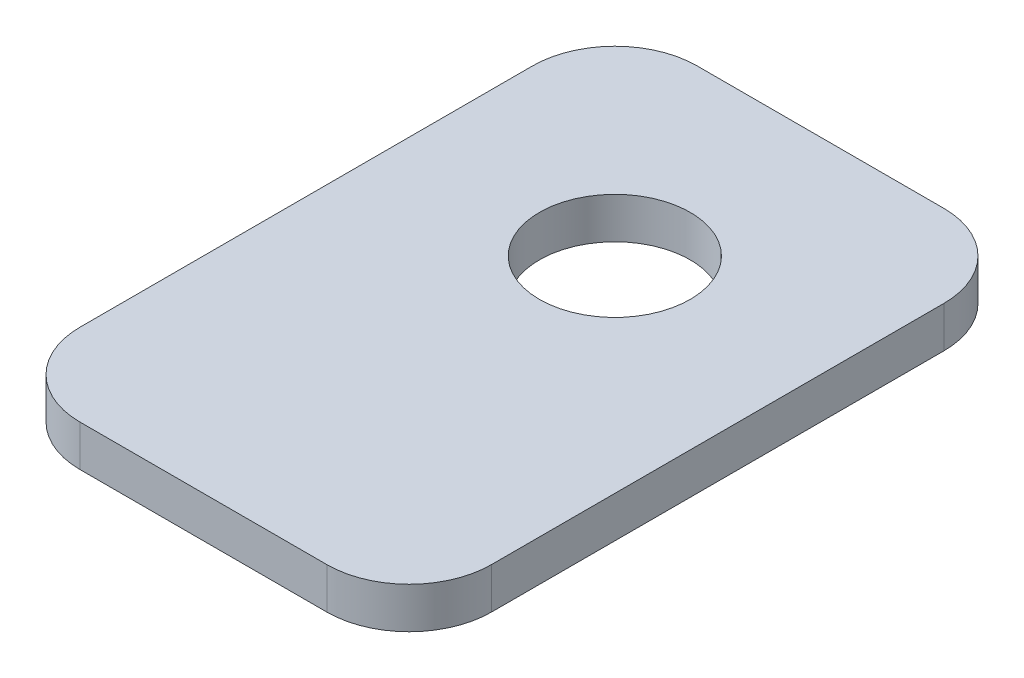
ISO-10303-21;
HEADER;
FILE_DESCRIPTION(('STEP AP214'),'2;1');
FILE_NAME('part.step','',(''),(''),'','','');
FILE_SCHEMA(('AUTOMOTIVE_DESIGN { 1 0 10303 214 1 1 1 1 }'));
ENDSEC;
DATA;
#1=APPLICATION_CONTEXT('core data for automotive mechanical design processes');
#2=APPLICATION_PROTOCOL_DEFINITION('international standard','automotive_design',2000,#1);
#3=PRODUCT_CONTEXT('',#1,'mechanical');
#4=PRODUCT('Part','Part','',(#3));
#5=PRODUCT_RELATED_PRODUCT_CATEGORY('part','',(#4));
#6=PRODUCT_DEFINITION_FORMATION('','',#4);
#7=PRODUCT_DEFINITION_CONTEXT('part definition',#1,'design');
#8=PRODUCT_DEFINITION('design','',#6,#7);
#9=PRODUCT_DEFINITION_SHAPE('','',#8);
#10=(LENGTH_UNIT() NAMED_UNIT(*) SI_UNIT(.MILLI.,.METRE.));
#11=(NAMED_UNIT(*) PLANE_ANGLE_UNIT() SI_UNIT($,.RADIAN.));
#12=(NAMED_UNIT(*) SI_UNIT($,.STERADIAN.) SOLID_ANGLE_UNIT());
#13=UNCERTAINTY_MEASURE_WITH_UNIT(LENGTH_MEASURE(1.E-05),#10,'distance_accuracy_value','');
#14=(GEOMETRIC_REPRESENTATION_CONTEXT(3) GLOBAL_UNCERTAINTY_ASSIGNED_CONTEXT((#13)) GLOBAL_UNIT_ASSIGNED_CONTEXT((#10,
#11,#12)) REPRESENTATION_CONTEXT('',''));
#15=CARTESIAN_POINT('',(0.,0.,0.));
#16=DIRECTION('',(0.,0.,1.));
#17=DIRECTION('',(1.,0.,0.));
#18=AXIS2_PLACEMENT_3D('',#15,#16,#17);
#19=CARTESIAN_POINT('',(0.,1.5,0.));
#20=DIRECTION('',(0.,1.,0.));
#21=DIRECTION('',(0.,0.,1.));
#22=AXIS2_PLACEMENT_3D('',#19,#20,#21);
#23=PLANE('',#22);
#24=CARTESIAN_POINT('',(0.,1.5,0.));
#25=DIRECTION('',(0.,1.,0.));
#26=DIRECTION('',(0.,0.,1.));
#27=AXIS2_PLACEMENT_3D('',#24,#25,#26);
#28=CIRCLE('',#27,2.75);
#29=CARTESIAN_POINT('',(0.,1.5,2.75));
#30=VERTEX_POINT('',#29);
#31=EDGE_CURVE('E156',#30,#30,#28,.F.);
#32=ORIENTED_EDGE('',*,*,#31,.T.);
#33=EDGE_LOOP('',(#32));
#34=FACE_BOUND('',#33,.T.);
#35=DIRECTION('',(1.,0.,0.));
#36=VECTOR('',#35,1.);
#37=CARTESIAN_POINT('',(-7.5,1.5,15.));
#38=LINE('',#37,#36);
#39=CARTESIAN_POINT('',(4.5,1.5,15.));
#40=VERTEX_POINT('',#39);
#41=CARTESIAN_POINT('',(-4.5,1.5,15.));
#42=VERTEX_POINT('',#41);
#43=EDGE_CURVE('E110',#40,#42,#38,.F.);
#44=ORIENTED_EDGE('',*,*,#43,.F.);
#45=CARTESIAN_POINT('',(4.5,1.5,12.));
#46=DIRECTION('',(0.,-1.,0.));
#47=DIRECTION('',(0.,0.,-1.));
#48=AXIS2_PLACEMENT_3D('',#45,#46,#47);
#49=CIRCLE('',#48,3.);
#50=CARTESIAN_POINT('',(7.5,1.5,12.));
#51=VERTEX_POINT('',#50);
#52=EDGE_CURVE('E19',#51,#40,#49,.T.);
#53=ORIENTED_EDGE('',*,*,#52,.F.);
#54=DIRECTION('',(0.,0.,-1.));
#55=VECTOR('',#54,1.);
#56=CARTESIAN_POINT('',(7.5,1.5,15.));
#57=LINE('',#56,#55);
#58=CARTESIAN_POINT('',(7.5,1.5,-4.5));
#59=VERTEX_POINT('',#58);
#60=EDGE_CURVE('E95',#59,#51,#57,.F.);
#61=ORIENTED_EDGE('',*,*,#60,.F.);
#62=CARTESIAN_POINT('',(4.5,1.5,-4.5));
#63=DIRECTION('',(0.,-1.,0.));
#64=DIRECTION('',(0.,0.,-1.));
#65=AXIS2_PLACEMENT_3D('',#62,#63,#64);
#66=CIRCLE('',#65,3.);
#67=CARTESIAN_POINT('',(4.5,1.5,-7.5));
#68=VERTEX_POINT('',#67);
#69=EDGE_CURVE('E119',#68,#59,#66,.T.);
#70=ORIENTED_EDGE('',*,*,#69,.F.);
#71=DIRECTION('',(-1.,0.,0.));
#72=VECTOR('',#71,1.);
#73=CARTESIAN_POINT('',(7.5,1.5,-7.5));
#74=LINE('',#73,#72);
#75=CARTESIAN_POINT('',(-4.5,1.5,-7.5));
#76=VERTEX_POINT('',#75);
#77=EDGE_CURVE('E135',#76,#68,#74,.F.);
#78=ORIENTED_EDGE('',*,*,#77,.F.);
#79=CARTESIAN_POINT('',(-4.5,1.5,-4.5));
#80=DIRECTION('',(0.,-1.,0.));
#81=DIRECTION('',(0.,0.,-1.));
#82=AXIS2_PLACEMENT_3D('',#79,#80,#81);
#83=CIRCLE('',#82,3.);
#84=CARTESIAN_POINT('',(-7.5,1.5,-4.5));
#85=VERTEX_POINT('',#84);
#86=EDGE_CURVE('E164',#85,#76,#83,.T.);
#87=ORIENTED_EDGE('',*,*,#86,.F.);
#88=DIRECTION('',(0.,0.,1.));
#89=VECTOR('',#88,1.);
#90=CARTESIAN_POINT('',(-7.5,1.5,-7.5));
#91=LINE('',#90,#89);
#92=CARTESIAN_POINT('',(-7.5,1.5,12.));
#93=VERTEX_POINT('',#92);
#94=EDGE_CURVE('E130',#93,#85,#91,.F.);
#95=ORIENTED_EDGE('',*,*,#94,.F.);
#96=CARTESIAN_POINT('',(-4.5,1.5,12.));
#97=DIRECTION('',(0.,-1.,0.));
#98=DIRECTION('',(0.,0.,-1.));
#99=AXIS2_PLACEMENT_3D('',#96,#97,#98);
#100=CIRCLE('',#99,3.);
#101=EDGE_CURVE('E161',#42,#93,#100,.T.);
#102=ORIENTED_EDGE('',*,*,#101,.F.);
#103=EDGE_LOOP('',(#44,#53,#61,#70,#78,#87,#95,#102));
#104=FACE_BOUND('',#103,.T.);
#105=ADVANCED_FACE('F16',(#34,#104),#23,.T.);
#106=CARTESIAN_POINT('',(4.5,5.259,12.));
#107=DIRECTION('',(0.,-1.,0.));
#108=DIRECTION('',(0.,0.,-1.));
#109=AXIS2_PLACEMENT_3D('',#106,#107,#108);
#110=CYLINDRICAL_SURFACE('',#109,3.);
#111=DIRECTION('',(0.,1.,0.));
#112=VECTOR('',#111,1.);
#113=CARTESIAN_POINT('',(4.5,0.,15.));
#114=LINE('',#113,#112);
#115=CARTESIAN_POINT('',(4.5,0.,15.));
#116=VERTEX_POINT('',#115);
#117=EDGE_CURVE('E160',#116,#40,#114,.T.);
#118=ORIENTED_EDGE('',*,*,#117,.F.);
#119=CARTESIAN_POINT('',(4.5,0.,12.));
#120=DIRECTION('',(0.,-1.,0.));
#121=DIRECTION('',(0.,0.,-1.));
#122=AXIS2_PLACEMENT_3D('',#119,#120,#121);
#123=CIRCLE('',#122,3.);
#124=CARTESIAN_POINT('',(7.5,0.,12.));
#125=VERTEX_POINT('',#124);
#126=EDGE_CURVE('E117',#116,#125,#123,.F.);
#127=ORIENTED_EDGE('',*,*,#126,.T.);
#128=DIRECTION('',(0.,1.,0.));
#129=VECTOR('',#128,1.);
#130=CARTESIAN_POINT('',(7.5,0.,12.));
#131=LINE('',#130,#129);
#132=EDGE_CURVE('E100',#51,#125,#131,.F.);
#133=ORIENTED_EDGE('',*,*,#132,.F.);
#134=ORIENTED_EDGE('',*,*,#52,.T.);
#135=EDGE_LOOP('',(#118,#127,#133,#134));
#136=FACE_BOUND('',#135,.T.);
#137=ADVANCED_FACE('F116',(#136),#110,.T.);
#138=CARTESIAN_POINT('',(7.5,0.,15.));
#139=DIRECTION('',(1.,0.,0.));
#140=DIRECTION('',(0.,0.,-1.));
#141=AXIS2_PLACEMENT_3D('',#138,#139,#140);
#142=PLANE('',#141);
#143=ORIENTED_EDGE('',*,*,#60,.T.);
#144=ORIENTED_EDGE('',*,*,#132,.T.);
#145=DIRECTION('',(0.,0.,1.));
#146=VECTOR('',#145,1.);
#147=CARTESIAN_POINT('',(7.5,0.,0.));
#148=LINE('',#147,#146);
#149=CARTESIAN_POINT('',(7.5,0.,-4.5));
#150=VERTEX_POINT('',#149);
#151=EDGE_CURVE('E153',#125,#150,#148,.F.);
#152=ORIENTED_EDGE('',*,*,#151,.T.);
#153=DIRECTION('',(0.,-1.,0.));
#154=VECTOR('',#153,1.);
#155=CARTESIAN_POINT('',(7.5,5.259,-4.5));
#156=LINE('',#155,#154);
#157=EDGE_CURVE('E102',#59,#150,#156,.T.);
#158=ORIENTED_EDGE('',*,*,#157,.F.);
#159=EDGE_LOOP('',(#143,#144,#152,#158));
#160=FACE_BOUND('',#159,.T.);
#161=ADVANCED_FACE('F97',(#160),#142,.T.);
#162=CARTESIAN_POINT('',(4.5,5.259,-4.5));
#163=DIRECTION('',(0.,-1.,0.));
#164=DIRECTION('',(0.,0.,-1.));
#165=AXIS2_PLACEMENT_3D('',#162,#163,#164);
#166=CYLINDRICAL_SURFACE('',#165,3.);
#167=ORIENTED_EDGE('',*,*,#157,.T.);
#168=CARTESIAN_POINT('',(4.5,0.,-4.5));
#169=DIRECTION('',(0.,-1.,0.));
#170=DIRECTION('',(0.,0.,-1.));
#171=AXIS2_PLACEMENT_3D('',#168,#169,#170);
#172=CIRCLE('',#171,3.);
#173=CARTESIAN_POINT('',(4.5,0.,-7.5));
#174=VERTEX_POINT('',#173);
#175=EDGE_CURVE('E149',#150,#174,#172,.F.);
#176=ORIENTED_EDGE('',*,*,#175,.T.);
#177=DIRECTION('',(0.,1.,0.));
#178=VECTOR('',#177,1.);
#179=CARTESIAN_POINT('',(4.5,0.,-7.5));
#180=LINE('',#179,#178);
#181=EDGE_CURVE('E137',#68,#174,#180,.F.);
#182=ORIENTED_EDGE('',*,*,#181,.F.);
#183=ORIENTED_EDGE('',*,*,#69,.T.);
#184=EDGE_LOOP('',(#167,#176,#182,#183));
#185=FACE_BOUND('',#184,.T.);
#186=ADVANCED_FACE('F210',(#185),#166,.T.);
#187=CARTESIAN_POINT('',(7.5,0.,-7.5));
#188=DIRECTION('',(0.,0.,-1.));
#189=DIRECTION('',(-1.,0.,0.));
#190=AXIS2_PLACEMENT_3D('',#187,#188,#189);
#191=PLANE('',#190);
#192=ORIENTED_EDGE('',*,*,#77,.T.);
#193=ORIENTED_EDGE('',*,*,#181,.T.);
#194=DIRECTION('',(1.,0.,0.));
#195=VECTOR('',#194,1.);
#196=CARTESIAN_POINT('',(0.,0.,-7.5));
#197=LINE('',#196,#195);
#198=CARTESIAN_POINT('',(-4.5,0.,-7.5));
#199=VERTEX_POINT('',#198);
#200=EDGE_CURVE('E148',#174,#199,#197,.F.);
#201=ORIENTED_EDGE('',*,*,#200,.T.);
#202=DIRECTION('',(0.,-1.,0.));
#203=VECTOR('',#202,1.);
#204=CARTESIAN_POINT('',(-4.5,5.259,-7.5));
#205=LINE('',#204,#203);
#206=EDGE_CURVE('E134',#76,#199,#205,.T.);
#207=ORIENTED_EDGE('',*,*,#206,.F.);
#208=EDGE_LOOP('',(#192,#193,#201,#207));
#209=FACE_BOUND('',#208,.T.);
#210=ADVANCED_FACE('F207',(#209),#191,.T.);
#211=CARTESIAN_POINT('',(-4.5,5.259,-4.5));
#212=DIRECTION('',(0.,-1.,0.));
#213=DIRECTION('',(0.,0.,-1.));
#214=AXIS2_PLACEMENT_3D('',#211,#212,#213);
#215=CYLINDRICAL_SURFACE('',#214,3.);
#216=ORIENTED_EDGE('',*,*,#206,.T.);
#217=CARTESIAN_POINT('',(-4.5,0.,-4.5));
#218=DIRECTION('',(0.,-1.,0.));
#219=DIRECTION('',(0.,0.,-1.));
#220=AXIS2_PLACEMENT_3D('',#217,#218,#219);
#221=CIRCLE('',#220,3.);
#222=CARTESIAN_POINT('',(-7.5,0.,-4.5));
#223=VERTEX_POINT('',#222);
#224=EDGE_CURVE('E144',#199,#223,#221,.F.);
#225=ORIENTED_EDGE('',*,*,#224,.T.);
#226=DIRECTION('',(0.,1.,0.));
#227=VECTOR('',#226,1.);
#228=CARTESIAN_POINT('',(-7.5,0.,-4.5));
#229=LINE('',#228,#227);
#230=EDGE_CURVE('E133',#85,#223,#229,.F.);
#231=ORIENTED_EDGE('',*,*,#230,.F.);
#232=ORIENTED_EDGE('',*,*,#86,.T.);
#233=EDGE_LOOP('',(#216,#225,#231,#232));
#234=FACE_BOUND('',#233,.T.);
#235=ADVANCED_FACE('F205',(#234),#215,.T.);
#236=CARTESIAN_POINT('',(-7.5,0.,-7.5));
#237=DIRECTION('',(-1.,0.,0.));
#238=DIRECTION('',(0.,0.,1.));
#239=AXIS2_PLACEMENT_3D('',#236,#237,#238);
#240=PLANE('',#239);
#241=ORIENTED_EDGE('',*,*,#94,.T.);
#242=ORIENTED_EDGE('',*,*,#230,.T.);
#243=DIRECTION('',(0.,0.,1.));
#244=VECTOR('',#243,1.);
#245=CARTESIAN_POINT('',(-7.5,0.,0.));
#246=LINE('',#245,#244);
#247=CARTESIAN_POINT('',(-7.5,0.,12.));
#248=VERTEX_POINT('',#247);
#249=EDGE_CURVE('E143',#223,#248,#246,.T.);
#250=ORIENTED_EDGE('',*,*,#249,.T.);
#251=DIRECTION('',(0.,-1.,0.));
#252=VECTOR('',#251,1.);
#253=CARTESIAN_POINT('',(-7.5,5.259,12.));
#254=LINE('',#253,#252);
#255=EDGE_CURVE('E129',#93,#248,#254,.T.);
#256=ORIENTED_EDGE('',*,*,#255,.F.);
#257=EDGE_LOOP('',(#241,#242,#250,#256));
#258=FACE_BOUND('',#257,.T.);
#259=ADVANCED_FACE('F203',(#258),#240,.T.);
#260=CARTESIAN_POINT('',(-4.5,5.259,12.));
#261=DIRECTION('',(0.,-1.,0.));
#262=DIRECTION('',(0.,0.,-1.));
#263=AXIS2_PLACEMENT_3D('',#260,#261,#262);
#264=CYLINDRICAL_SURFACE('',#263,3.);
#265=ORIENTED_EDGE('',*,*,#255,.T.);
#266=CARTESIAN_POINT('',(-4.5,0.,12.));
#267=DIRECTION('',(0.,-1.,0.));
#268=DIRECTION('',(0.,0.,-1.));
#269=AXIS2_PLACEMENT_3D('',#266,#267,#268);
#270=CIRCLE('',#269,3.);
#271=CARTESIAN_POINT('',(-4.5,0.,15.));
#272=VERTEX_POINT('',#271);
#273=EDGE_CURVE('E139',#248,#272,#270,.F.);
#274=ORIENTED_EDGE('',*,*,#273,.T.);
#275=DIRECTION('',(0.,1.,0.));
#276=VECTOR('',#275,1.);
#277=CARTESIAN_POINT('',(-4.5,0.,15.));
#278=LINE('',#277,#276);
#279=EDGE_CURVE('E39',#42,#272,#278,.F.);
#280=ORIENTED_EDGE('',*,*,#279,.F.);
#281=ORIENTED_EDGE('',*,*,#101,.T.);
#282=EDGE_LOOP('',(#265,#274,#280,#281));
#283=FACE_BOUND('',#282,.T.);
#284=ADVANCED_FACE('F199',(#283),#264,.T.);
#285=CARTESIAN_POINT('',(-7.5,0.,15.));
#286=DIRECTION('',(0.,0.,1.));
#287=DIRECTION('',(1.,0.,0.));
#288=AXIS2_PLACEMENT_3D('',#285,#286,#287);
#289=PLANE('',#288);
#290=DIRECTION('',(1.,0.,0.));
#291=VECTOR('',#290,1.);
#292=CARTESIAN_POINT('',(0.,0.,15.));
#293=LINE('',#292,#291);
#294=EDGE_CURVE('E26',#272,#116,#293,.T.);
#295=ORIENTED_EDGE('',*,*,#294,.T.);
#296=ORIENTED_EDGE('',*,*,#117,.T.);
#297=ORIENTED_EDGE('',*,*,#43,.T.);
#298=ORIENTED_EDGE('',*,*,#279,.T.);
#299=EDGE_LOOP('',(#295,#296,#297,#298));
#300=FACE_BOUND('',#299,.T.);
#301=ADVANCED_FACE('F193',(#300),#289,.T.);
#302=CARTESIAN_POINT('',(0.,0.,0.));
#303=DIRECTION('',(0.,1.,0.));
#304=DIRECTION('',(0.,0.,1.));
#305=AXIS2_PLACEMENT_3D('',#302,#303,#304);
#306=CYLINDRICAL_SURFACE('',#305,2.75);
#307=ORIENTED_EDGE('',*,*,#31,.F.);
#308=EDGE_LOOP('',(#307));
#309=FACE_BOUND('',#308,.T.);
#310=CARTESIAN_POINT('',(0.,0.,0.));
#311=DIRECTION('',(0.,1.,0.));
#312=DIRECTION('',(0.,0.,1.));
#313=AXIS2_PLACEMENT_3D('',#310,#311,#312);
#314=CIRCLE('',#313,2.75);
#315=CARTESIAN_POINT('',(0.,0.,2.75));
#316=VERTEX_POINT('',#315);
#317=EDGE_CURVE('E11',#316,#316,#314,.F.);
#318=ORIENTED_EDGE('',*,*,#317,.T.);
#319=EDGE_LOOP('',(#318));
#320=FACE_BOUND('',#319,.T.);
#321=ADVANCED_FACE('F224',(#309,#320),#306,.F.);
#322=CARTESIAN_POINT('',(0.,0.,0.));
#323=DIRECTION('',(0.,1.,0.));
#324=DIRECTION('',(0.,0.,1.));
#325=AXIS2_PLACEMENT_3D('',#322,#323,#324);
#326=PLANE('',#325);
#327=ORIENTED_EDGE('',*,*,#317,.F.);
#328=EDGE_LOOP('',(#327));
#329=FACE_BOUND('',#328,.T.);
#330=ORIENTED_EDGE('',*,*,#273,.F.);
#331=ORIENTED_EDGE('',*,*,#249,.F.);
#332=ORIENTED_EDGE('',*,*,#224,.F.);
#333=ORIENTED_EDGE('',*,*,#200,.F.);
#334=ORIENTED_EDGE('',*,*,#175,.F.);
#335=ORIENTED_EDGE('',*,*,#151,.F.);
#336=ORIENTED_EDGE('',*,*,#126,.F.);
#337=ORIENTED_EDGE('',*,*,#294,.F.);
#338=EDGE_LOOP('',(#330,#331,#332,#333,#334,#335,#336,#337));
#339=FACE_BOUND('',#338,.T.);
#340=ADVANCED_FACE('F196',(#329,#339),#326,.F.);
#341=CLOSED_SHELL('',(#105,#137,#161,#186,#210,#235,#259,#284,#301,#321,#340));
#342=MANIFOLD_SOLID_BREP('B1',#341);
#343=ADVANCED_BREP_SHAPE_REPRESENTATION('',(#18,#342),#14);
#344=SHAPE_DEFINITION_REPRESENTATION(#9,#343);
ENDSEC;
END-ISO-10303-21;
